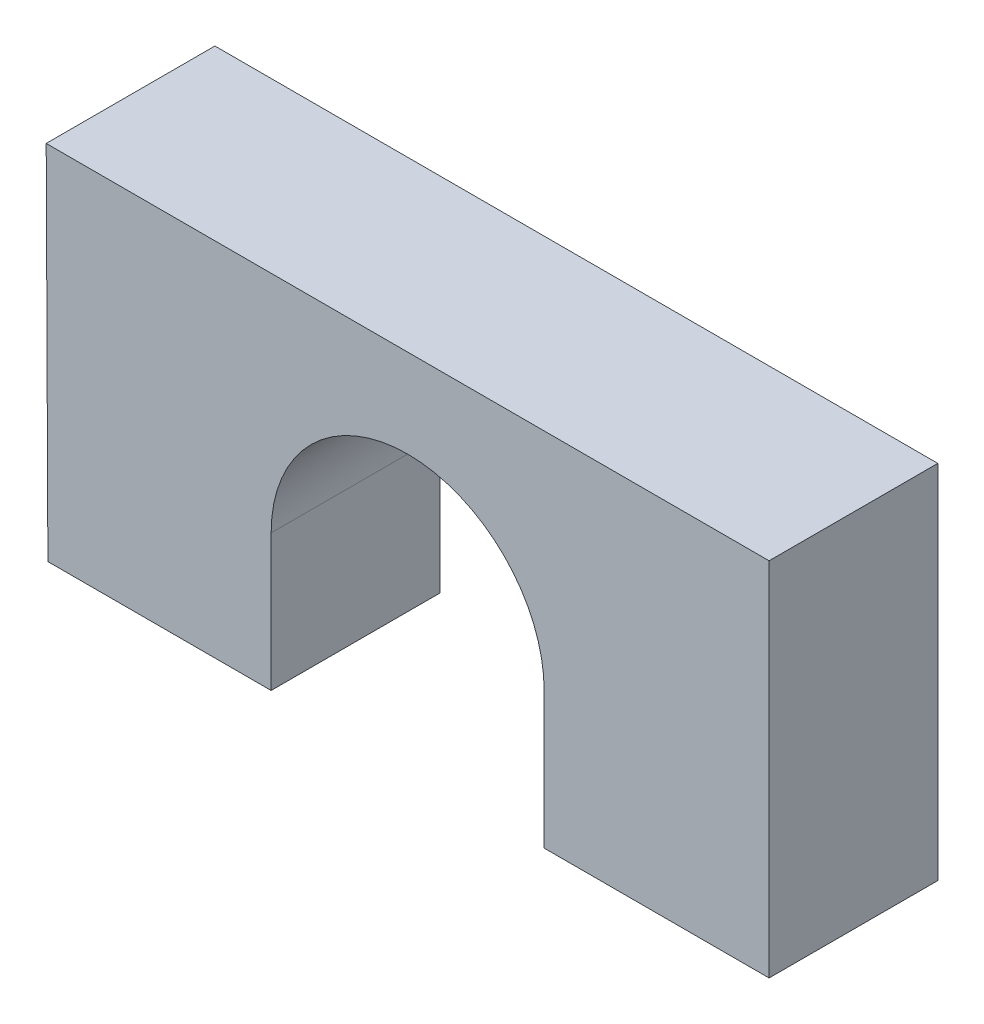
ISO-10303-21;
HEADER;
FILE_DESCRIPTION(('STEP AP214'),'2;1');
FILE_NAME('part.step','',(''),(''),'','','');
FILE_SCHEMA(('AUTOMOTIVE_DESIGN { 1 0 10303 214 1 1 1 1 }'));
ENDSEC;
DATA;
#1=APPLICATION_CONTEXT('core data for automotive mechanical design processes');
#2=APPLICATION_PROTOCOL_DEFINITION('international standard','automotive_design',2000,#1);
#3=PRODUCT_CONTEXT('',#1,'mechanical');
#4=PRODUCT('Part','Part','',(#3));
#5=PRODUCT_RELATED_PRODUCT_CATEGORY('part','',(#4));
#6=PRODUCT_DEFINITION_FORMATION('','',#4);
#7=PRODUCT_DEFINITION_CONTEXT('part definition',#1,'design');
#8=PRODUCT_DEFINITION('design','',#6,#7);
#9=PRODUCT_DEFINITION_SHAPE('','',#8);
#10=(LENGTH_UNIT() NAMED_UNIT(*) SI_UNIT(.MILLI.,.METRE.));
#11=(NAMED_UNIT(*) PLANE_ANGLE_UNIT() SI_UNIT($,.RADIAN.));
#12=(NAMED_UNIT(*) SI_UNIT($,.STERADIAN.) SOLID_ANGLE_UNIT());
#13=UNCERTAINTY_MEASURE_WITH_UNIT(LENGTH_MEASURE(1.E-05),#10,'distance_accuracy_value','');
#14=(GEOMETRIC_REPRESENTATION_CONTEXT(3) GLOBAL_UNCERTAINTY_ASSIGNED_CONTEXT((#13)) GLOBAL_UNIT_ASSIGNED_CONTEXT((#10,
#11,#12)) REPRESENTATION_CONTEXT('',''));
#15=CARTESIAN_POINT('',(0.,0.,0.));
#16=DIRECTION('',(0.,0.,1.));
#17=DIRECTION('',(1.,0.,0.));
#18=AXIS2_PLACEMENT_3D('',#15,#16,#17);
#19=CARTESIAN_POINT('',(0.,0.,6.));
#20=DIRECTION('',(0.,0.,-1.));
#21=DIRECTION('',(-1.,0.,0.));
#22=AXIS2_PLACEMENT_3D('',#19,#20,#21);
#23=CYLINDRICAL_SURFACE('',#22,4.855);
#24=CARTESIAN_POINT('',(0.,0.,0.));
#25=DIRECTION('',(0.,0.,-1.));
#26=DIRECTION('',(1.,0.,0.));
#27=AXIS2_PLACEMENT_3D('',#24,#25,#26);
#28=CIRCLE('',#27,4.855);
#29=CARTESIAN_POINT('',(-4.855,0.,0.));
#30=VERTEX_POINT('',#29);
#31=CARTESIAN_POINT('',(4.855,0.,0.));
#32=VERTEX_POINT('',#31);
#33=EDGE_CURVE('E129',#30,#32,#28,.T.);
#34=ORIENTED_EDGE('',*,*,#33,.T.);
#35=DIRECTION('',(0.,0.,-1.));
#36=VECTOR('',#35,1.);
#37=CARTESIAN_POINT('',(4.855,0.,6.));
#38=LINE('',#37,#36);
#39=CARTESIAN_POINT('',(4.855,0.,6.));
#40=VERTEX_POINT('',#39);
#41=EDGE_CURVE('E11',#40,#32,#38,.T.);
#42=ORIENTED_EDGE('',*,*,#41,.F.);
#43=CARTESIAN_POINT('',(0.,0.,6.));
#44=DIRECTION('',(0.,0.,-1.));
#45=DIRECTION('',(1.,0.,0.));
#46=AXIS2_PLACEMENT_3D('',#43,#44,#45);
#47=CIRCLE('',#46,4.855);
#48=CARTESIAN_POINT('',(-4.855,0.,6.));
#49=VERTEX_POINT('',#48);
#50=EDGE_CURVE('E143',#49,#40,#47,.T.);
#51=ORIENTED_EDGE('',*,*,#50,.F.);
#52=DIRECTION('',(0.,0.,-1.));
#53=VECTOR('',#52,1.);
#54=CARTESIAN_POINT('',(-4.855,0.,6.));
#55=LINE('',#54,#53);
#56=EDGE_CURVE('E125',#49,#30,#55,.T.);
#57=ORIENTED_EDGE('',*,*,#56,.T.);
#58=EDGE_LOOP('',(#34,#42,#51,#57));
#59=FACE_BOUND('',#58,.T.);
#60=ADVANCED_FACE('F33',(#59),#23,.F.);
#61=CARTESIAN_POINT('',(4.855,0.,6.));
#62=DIRECTION('',(1.,0.,0.));
#63=DIRECTION('',(0.,0.,-1.));
#64=AXIS2_PLACEMENT_3D('',#61,#62,#63);
#65=PLANE('',#64);
#66=DIRECTION('',(0.,-1.,0.));
#67=VECTOR('',#66,1.);
#68=CARTESIAN_POINT('',(4.855,0.,0.));
#69=LINE('',#68,#67);
#70=CARTESIAN_POINT('',(4.855,-4.855,0.));
#71=VERTEX_POINT('',#70);
#72=EDGE_CURVE('E132',#32,#71,#69,.T.);
#73=ORIENTED_EDGE('',*,*,#72,.T.);
#74=DIRECTION('',(0.,0.,-1.));
#75=VECTOR('',#74,1.);
#76=CARTESIAN_POINT('',(4.855,-4.855,6.));
#77=LINE('',#76,#75);
#78=CARTESIAN_POINT('',(4.855,-4.855,6.));
#79=VERTEX_POINT('',#78);
#80=EDGE_CURVE('E41',#79,#71,#77,.T.);
#81=ORIENTED_EDGE('',*,*,#80,.F.);
#82=DIRECTION('',(0.,-1.,0.));
#83=VECTOR('',#82,1.);
#84=CARTESIAN_POINT('',(4.855,0.,6.));
#85=LINE('',#84,#83);
#86=EDGE_CURVE('E92',#40,#79,#85,.T.);
#87=ORIENTED_EDGE('',*,*,#86,.F.);
#88=ORIENTED_EDGE('',*,*,#41,.T.);
#89=EDGE_LOOP('',(#73,#81,#87,#88));
#90=FACE_BOUND('',#89,.T.);
#91=ADVANCED_FACE('F178',(#90),#65,.F.);
#92=CARTESIAN_POINT('',(4.855,-4.855,6.));
#93=DIRECTION('',(0.,1.,0.));
#94=DIRECTION('',(0.,0.,1.));
#95=AXIS2_PLACEMENT_3D('',#92,#93,#94);
#96=PLANE('',#95);
#97=DIRECTION('',(1.,0.,0.));
#98=VECTOR('',#97,1.);
#99=CARTESIAN_POINT('',(4.855,-4.855,0.));
#100=LINE('',#99,#98);
#101=CARTESIAN_POINT('',(12.855,-4.855,0.));
#102=VERTEX_POINT('',#101);
#103=EDGE_CURVE('E134',#71,#102,#100,.T.);
#104=ORIENTED_EDGE('',*,*,#103,.T.);
#105=DIRECTION('',(0.,0.,-1.));
#106=VECTOR('',#105,1.);
#107=CARTESIAN_POINT('',(12.855,-4.855,6.));
#108=LINE('',#107,#106);
#109=CARTESIAN_POINT('',(12.855,-4.855,6.));
#110=VERTEX_POINT('',#109);
#111=EDGE_CURVE('E150',#110,#102,#108,.T.);
#112=ORIENTED_EDGE('',*,*,#111,.F.);
#113=DIRECTION('',(1.,0.,0.));
#114=VECTOR('',#113,1.);
#115=CARTESIAN_POINT('',(4.855,-4.855,6.));
#116=LINE('',#115,#114);
#117=EDGE_CURVE('E158',#79,#110,#116,.T.);
#118=ORIENTED_EDGE('',*,*,#117,.F.);
#119=ORIENTED_EDGE('',*,*,#80,.T.);
#120=EDGE_LOOP('',(#104,#112,#118,#119));
#121=FACE_BOUND('',#120,.T.);
#122=ADVANCED_FACE('F156',(#121),#96,.F.);
#123=CARTESIAN_POINT('',(12.855,7.99580223231211,6.));
#124=DIRECTION('',(-1.,0.,0.));
#125=DIRECTION('',(0.,0.,1.));
#126=AXIS2_PLACEMENT_3D('',#123,#124,#125);
#127=PLANE('',#126);
#128=DIRECTION('',(0.,1.,0.));
#129=VECTOR('',#128,1.);
#130=CARTESIAN_POINT('',(12.855,7.99580223231211,0.));
#131=LINE('',#130,#129);
#132=CARTESIAN_POINT('',(12.855,7.99580223231211,0.));
#133=VERTEX_POINT('',#132);
#134=EDGE_CURVE('E136',#102,#133,#131,.T.);
#135=ORIENTED_EDGE('',*,*,#134,.T.);
#136=DIRECTION('',(0.,0.,-1.));
#137=VECTOR('',#136,1.);
#138=CARTESIAN_POINT('',(12.855,7.99580223231211,6.));
#139=LINE('',#138,#137);
#140=CARTESIAN_POINT('',(12.855,7.99580223231211,6.));
#141=VERTEX_POINT('',#140);
#142=EDGE_CURVE('E147',#141,#133,#139,.T.);
#143=ORIENTED_EDGE('',*,*,#142,.F.);
#144=DIRECTION('',(0.,1.,0.));
#145=VECTOR('',#144,1.);
#146=CARTESIAN_POINT('',(12.855,7.99580223231211,6.));
#147=LINE('',#146,#145);
#148=EDGE_CURVE('E170',#110,#141,#147,.T.);
#149=ORIENTED_EDGE('',*,*,#148,.F.);
#150=ORIENTED_EDGE('',*,*,#111,.T.);
#151=EDGE_LOOP('',(#135,#143,#149,#150));
#152=FACE_BOUND('',#151,.T.);
#153=ADVANCED_FACE('F166',(#152),#127,.F.);
#154=CARTESIAN_POINT('',(-12.855,7.99580223231211,6.));
#155=DIRECTION('',(0.,-1.,0.));
#156=DIRECTION('',(0.,0.,-1.));
#157=AXIS2_PLACEMENT_3D('',#154,#155,#156);
#158=PLANE('',#157);
#159=DIRECTION('',(-1.,0.,0.));
#160=VECTOR('',#159,1.);
#161=CARTESIAN_POINT('',(-12.855,7.99580223231211,0.));
#162=LINE('',#161,#160);
#163=CARTESIAN_POINT('',(-12.855,7.99580223231211,0.));
#164=VERTEX_POINT('',#163);
#165=EDGE_CURVE('E138',#133,#164,#162,.T.);
#166=ORIENTED_EDGE('',*,*,#165,.T.);
#167=DIRECTION('',(0.,0.,-1.));
#168=VECTOR('',#167,1.);
#169=CARTESIAN_POINT('',(-12.855,7.99580223231211,6.));
#170=LINE('',#169,#168);
#171=CARTESIAN_POINT('',(-12.855,7.99580223231211,6.));
#172=VERTEX_POINT('',#171);
#173=EDGE_CURVE('E120',#172,#164,#170,.T.);
#174=ORIENTED_EDGE('',*,*,#173,.F.);
#175=DIRECTION('',(-1.,0.,0.));
#176=VECTOR('',#175,1.);
#177=CARTESIAN_POINT('',(-12.855,7.99580223231211,6.));
#178=LINE('',#177,#176);
#179=EDGE_CURVE('E111',#141,#172,#178,.T.);
#180=ORIENTED_EDGE('',*,*,#179,.F.);
#181=ORIENTED_EDGE('',*,*,#142,.T.);
#182=EDGE_LOOP('',(#166,#174,#180,#181));
#183=FACE_BOUND('',#182,.T.);
#184=ADVANCED_FACE('F169',(#183),#158,.F.);
#185=CARTESIAN_POINT('',(-12.855,7.99580223231211,6.));
#186=DIRECTION('',(0.999989031635852,0.00468365327390236,0.));
#187=DIRECTION('',(-0.00468365327390236,0.999989031635853,0.));
#188=AXIS2_PLACEMENT_3D('',#185,#186,#187);
#189=PLANE('',#188);
#190=DIRECTION('',(0.00468365327390236,-0.999989031635853,0.));
#191=VECTOR('',#190,1.);
#192=CARTESIAN_POINT('',(-12.855,7.99580223231211,0.));
#193=LINE('',#192,#191);
#194=CARTESIAN_POINT('',(-12.7948106378735,-4.855,0.));
#195=VERTEX_POINT('',#194);
#196=EDGE_CURVE('E119',#164,#195,#193,.T.);
#197=ORIENTED_EDGE('',*,*,#196,.T.);
#198=DIRECTION('',(0.,0.,-1.));
#199=VECTOR('',#198,1.);
#200=CARTESIAN_POINT('',(-12.7948106378735,-4.855,6.));
#201=LINE('',#200,#199);
#202=CARTESIAN_POINT('',(-12.7948106378735,-4.855,6.));
#203=VERTEX_POINT('',#202);
#204=EDGE_CURVE('E116',#203,#195,#201,.T.);
#205=ORIENTED_EDGE('',*,*,#204,.F.);
#206=DIRECTION('',(0.00468365327390236,-0.999989031635853,0.));
#207=VECTOR('',#206,1.);
#208=CARTESIAN_POINT('',(-12.855,7.99580223231211,6.));
#209=LINE('',#208,#207);
#210=EDGE_CURVE('E105',#172,#203,#209,.T.);
#211=ORIENTED_EDGE('',*,*,#210,.F.);
#212=ORIENTED_EDGE('',*,*,#173,.T.);
#213=EDGE_LOOP('',(#197,#205,#211,#212));
#214=FACE_BOUND('',#213,.T.);
#215=ADVANCED_FACE('F117',(#214),#189,.F.);
#216=CARTESIAN_POINT('',(-4.855,-4.855,6.));
#217=DIRECTION('',(0.,1.,0.));
#218=DIRECTION('',(0.,0.,1.));
#219=AXIS2_PLACEMENT_3D('',#216,#217,#218);
#220=PLANE('',#219);
#221=DIRECTION('',(1.,0.,0.));
#222=VECTOR('',#221,1.);
#223=CARTESIAN_POINT('',(-4.855,-4.855,0.));
#224=LINE('',#223,#222);
#225=CARTESIAN_POINT('',(-4.855,-4.855,0.));
#226=VERTEX_POINT('',#225);
#227=EDGE_CURVE('E78',#195,#226,#224,.T.);
#228=ORIENTED_EDGE('',*,*,#227,.T.);
#229=DIRECTION('',(0.,0.,-1.));
#230=VECTOR('',#229,1.);
#231=CARTESIAN_POINT('',(-4.855,-4.855,6.));
#232=LINE('',#231,#230);
#233=CARTESIAN_POINT('',(-4.855,-4.855,6.));
#234=VERTEX_POINT('',#233);
#235=EDGE_CURVE('E121',#234,#226,#232,.T.);
#236=ORIENTED_EDGE('',*,*,#235,.F.);
#237=DIRECTION('',(1.,0.,0.));
#238=VECTOR('',#237,1.);
#239=CARTESIAN_POINT('',(-4.855,-4.855,6.));
#240=LINE('',#239,#238);
#241=EDGE_CURVE('E109',#203,#234,#240,.T.);
#242=ORIENTED_EDGE('',*,*,#241,.F.);
#243=ORIENTED_EDGE('',*,*,#204,.T.);
#244=EDGE_LOOP('',(#228,#236,#242,#243));
#245=FACE_BOUND('',#244,.T.);
#246=ADVANCED_FACE('F123',(#245),#220,.F.);
#247=CARTESIAN_POINT('',(-4.855,0.,6.));
#248=DIRECTION('',(-1.,0.,0.));
#249=DIRECTION('',(0.,0.,1.));
#250=AXIS2_PLACEMENT_3D('',#247,#248,#249);
#251=PLANE('',#250);
#252=DIRECTION('',(0.,1.,0.));
#253=VECTOR('',#252,1.);
#254=CARTESIAN_POINT('',(-4.855,0.,0.));
#255=LINE('',#254,#253);
#256=EDGE_CURVE('E84',#226,#30,#255,.T.);
#257=ORIENTED_EDGE('',*,*,#256,.T.);
#258=ORIENTED_EDGE('',*,*,#56,.F.);
#259=DIRECTION('',(0.,1.,0.));
#260=VECTOR('',#259,1.);
#261=CARTESIAN_POINT('',(-4.855,0.,6.));
#262=LINE('',#261,#260);
#263=EDGE_CURVE('E49',#234,#49,#262,.T.);
#264=ORIENTED_EDGE('',*,*,#263,.F.);
#265=ORIENTED_EDGE('',*,*,#235,.T.);
#266=EDGE_LOOP('',(#257,#258,#264,#265));
#267=FACE_BOUND('',#266,.T.);
#268=ADVANCED_FACE('F194',(#267),#251,.F.);
#269=CARTESIAN_POINT('',(0.,0.,6.));
#270=DIRECTION('',(0.,0.,1.));
#271=DIRECTION('',(1.,0.,0.));
#272=AXIS2_PLACEMENT_3D('',#269,#270,#271);
#273=PLANE('',#272);
#274=ORIENTED_EDGE('',*,*,#50,.T.);
#275=ORIENTED_EDGE('',*,*,#86,.T.);
#276=ORIENTED_EDGE('',*,*,#117,.T.);
#277=ORIENTED_EDGE('',*,*,#148,.T.);
#278=ORIENTED_EDGE('',*,*,#179,.T.);
#279=ORIENTED_EDGE('',*,*,#210,.T.);
#280=ORIENTED_EDGE('',*,*,#241,.T.);
#281=ORIENTED_EDGE('',*,*,#263,.T.);
#282=EDGE_LOOP('',(#274,#275,#276,#277,#278,#279,#280,#281));
#283=FACE_BOUND('',#282,.T.);
#284=ADVANCED_FACE('F107',(#283),#273,.T.);
#285=CARTESIAN_POINT('',(0.,0.,0.));
#286=DIRECTION('',(0.,0.,1.));
#287=DIRECTION('',(1.,0.,0.));
#288=AXIS2_PLACEMENT_3D('',#285,#286,#287);
#289=PLANE('',#288);
#290=ORIENTED_EDGE('',*,*,#33,.F.);
#291=ORIENTED_EDGE('',*,*,#256,.F.);
#292=ORIENTED_EDGE('',*,*,#227,.F.);
#293=ORIENTED_EDGE('',*,*,#196,.F.);
#294=ORIENTED_EDGE('',*,*,#165,.F.);
#295=ORIENTED_EDGE('',*,*,#134,.F.);
#296=ORIENTED_EDGE('',*,*,#103,.F.);
#297=ORIENTED_EDGE('',*,*,#72,.F.);
#298=EDGE_LOOP('',(#290,#291,#292,#293,#294,#295,#296,#297));
#299=FACE_BOUND('',#298,.T.);
#300=ADVANCED_FACE('F162',(#299),#289,.F.);
#301=CLOSED_SHELL('',(#60,#91,#122,#153,#184,#215,#246,#268,#284,#300));
#302=MANIFOLD_SOLID_BREP('B2',#301);
#303=ADVANCED_BREP_SHAPE_REPRESENTATION('',(#18,#302),#14);
#304=SHAPE_DEFINITION_REPRESENTATION(#9,#303);
ENDSEC;
END-ISO-10303-21;
